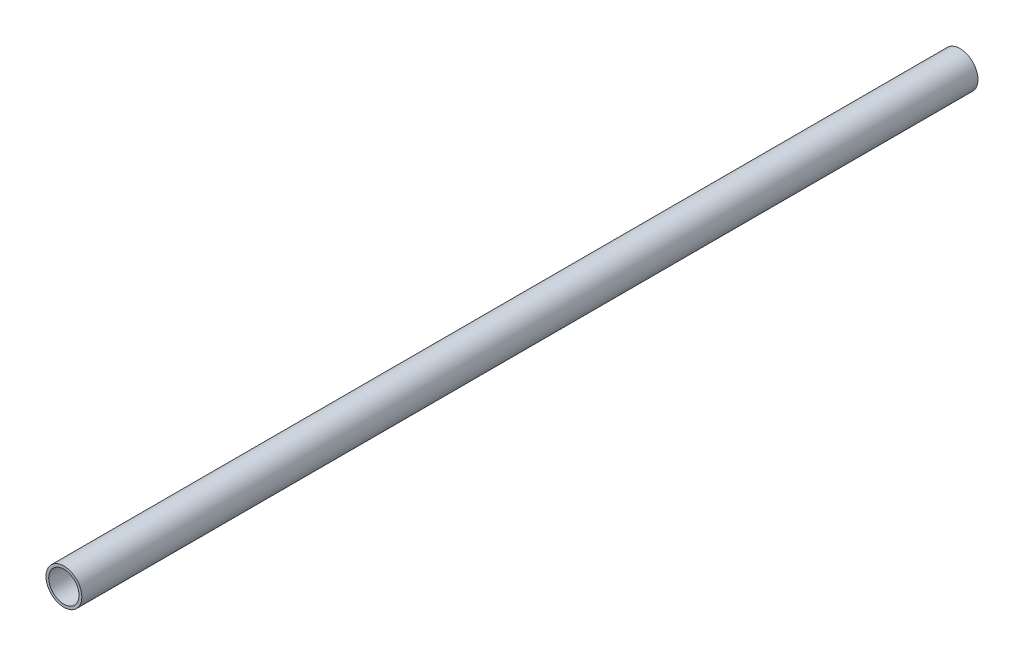
ISO-10303-21;
HEADER;
FILE_DESCRIPTION(('STEP AP214'),'2;1');
FILE_NAME('part.step','',(''),(''),'','','');
FILE_SCHEMA(('AUTOMOTIVE_DESIGN { 1 0 10303 214 1 1 1 1 }'));
ENDSEC;
DATA;
#1=APPLICATION_CONTEXT('core data for automotive mechanical design processes');
#2=APPLICATION_PROTOCOL_DEFINITION('international standard','automotive_design',2000,#1);
#3=PRODUCT_CONTEXT('',#1,'mechanical');
#4=PRODUCT('Part','Part','',(#3));
#5=PRODUCT_RELATED_PRODUCT_CATEGORY('part','',(#4));
#6=PRODUCT_DEFINITION_FORMATION('','',#4);
#7=PRODUCT_DEFINITION_CONTEXT('part definition',#1,'design');
#8=PRODUCT_DEFINITION('design','',#6,#7);
#9=PRODUCT_DEFINITION_SHAPE('','',#8);
#10=(LENGTH_UNIT() NAMED_UNIT(*) SI_UNIT(.MILLI.,.METRE.));
#11=(NAMED_UNIT(*) PLANE_ANGLE_UNIT() SI_UNIT($,.RADIAN.));
#12=(NAMED_UNIT(*) SI_UNIT($,.STERADIAN.) SOLID_ANGLE_UNIT());
#13=UNCERTAINTY_MEASURE_WITH_UNIT(LENGTH_MEASURE(1.E-05),#10,'distance_accuracy_value','');
#14=(GEOMETRIC_REPRESENTATION_CONTEXT(3) GLOBAL_UNCERTAINTY_ASSIGNED_CONTEXT((#13)) GLOBAL_UNIT_ASSIGNED_CONTEXT((#10,
#11,#12)) REPRESENTATION_CONTEXT('',''));
#15=CARTESIAN_POINT('',(0.,0.,0.));
#16=DIRECTION('',(0.,0.,1.));
#17=DIRECTION('',(1.,0.,0.));
#18=AXIS2_PLACEMENT_3D('',#15,#16,#17);
#19=CARTESIAN_POINT('',(0.,0.,1500.));
#20=DIRECTION('',(0.,0.,-1.));
#21=DIRECTION('',(-1.,0.,0.));
#22=AXIS2_PLACEMENT_3D('',#19,#20,#21);
#23=CYLINDRICAL_SURFACE('',#22,30.);
#24=CARTESIAN_POINT('',(0.,0.,1500.));
#25=DIRECTION('',(0.,0.,1.));
#26=DIRECTION('',(1.,0.,0.));
#27=AXIS2_PLACEMENT_3D('',#24,#25,#26);
#28=CIRCLE('',#27,30.);
#29=CARTESIAN_POINT('',(30.,0.,1500.));
#30=VERTEX_POINT('',#29);
#31=EDGE_CURVE('E10',#30,#30,#28,.T.);
#32=ORIENTED_EDGE('',*,*,#31,.F.);
#33=EDGE_LOOP('',(#32));
#34=FACE_BOUND('',#33,.T.);
#35=CARTESIAN_POINT('',(0.,0.,0.));
#36=DIRECTION('',(0.,0.,1.));
#37=DIRECTION('',(1.,0.,0.));
#38=AXIS2_PLACEMENT_3D('',#35,#36,#37);
#39=CIRCLE('',#38,30.);
#40=CARTESIAN_POINT('',(30.,0.,0.));
#41=VERTEX_POINT('',#40);
#42=EDGE_CURVE('E40',#41,#41,#39,.T.);
#43=ORIENTED_EDGE('',*,*,#42,.T.);
#44=EDGE_LOOP('',(#43));
#45=FACE_BOUND('',#44,.T.);
#46=ADVANCED_FACE('F37',(#34,#45),#23,.T.);
#47=CARTESIAN_POINT('',(0.,0.,1500.));
#48=DIRECTION('',(0.,0.,1.));
#49=DIRECTION('',(1.,0.,0.));
#50=AXIS2_PLACEMENT_3D('',#47,#48,#49);
#51=PLANE('',#50);
#52=CARTESIAN_POINT('',(0.,0.,1500.));
#53=DIRECTION('',(0.,0.,1.));
#54=DIRECTION('',(1.,0.,0.));
#55=AXIS2_PLACEMENT_3D('',#52,#53,#54);
#56=CIRCLE('',#55,25.4);
#57=CARTESIAN_POINT('',(25.4,0.,1500.));
#58=VERTEX_POINT('',#57);
#59=EDGE_CURVE('E51',#58,#58,#56,.T.);
#60=ORIENTED_EDGE('',*,*,#59,.F.);
#61=EDGE_LOOP('',(#60));
#62=FACE_BOUND('',#61,.T.);
#63=ORIENTED_EDGE('',*,*,#31,.T.);
#64=EDGE_LOOP('',(#63));
#65=FACE_BOUND('',#64,.T.);
#66=ADVANCED_FACE('F68',(#62,#65),#51,.T.);
#67=CARTESIAN_POINT('',(0.,0.,0.));
#68=DIRECTION('',(0.,0.,1.));
#69=DIRECTION('',(1.,0.,0.));
#70=AXIS2_PLACEMENT_3D('',#67,#68,#69);
#71=PLANE('',#70);
#72=CARTESIAN_POINT('',(0.,0.,0.));
#73=DIRECTION('',(0.,0.,1.));
#74=DIRECTION('',(1.,0.,0.));
#75=AXIS2_PLACEMENT_3D('',#72,#73,#74);
#76=CIRCLE('',#75,25.4);
#77=CARTESIAN_POINT('',(25.4,0.,0.));
#78=VERTEX_POINT('',#77);
#79=EDGE_CURVE('E49',#78,#78,#76,.T.);
#80=ORIENTED_EDGE('',*,*,#79,.T.);
#81=EDGE_LOOP('',(#80));
#82=FACE_BOUND('',#81,.T.);
#83=ORIENTED_EDGE('',*,*,#42,.F.);
#84=EDGE_LOOP('',(#83));
#85=FACE_BOUND('',#84,.T.);
#86=ADVANCED_FACE('F59',(#82,#85),#71,.F.);
#87=CARTESIAN_POINT('',(0.,0.,0.));
#88=DIRECTION('',(0.,0.,1.));
#89=DIRECTION('',(1.,0.,0.));
#90=AXIS2_PLACEMENT_3D('',#87,#88,#89);
#91=CYLINDRICAL_SURFACE('',#90,25.4);
#92=ORIENTED_EDGE('',*,*,#79,.F.);
#93=EDGE_LOOP('',(#92));
#94=FACE_BOUND('',#93,.T.);
#95=ORIENTED_EDGE('',*,*,#59,.T.);
#96=EDGE_LOOP('',(#95));
#97=FACE_BOUND('',#96,.T.);
#98=ADVANCED_FACE('F62',(#94,#97),#91,.F.);
#99=CLOSED_SHELL('',(#46,#66,#86,#98));
#100=MANIFOLD_SOLID_BREP('B2',#99);
#101=ADVANCED_BREP_SHAPE_REPRESENTATION('',(#18,#100),#14);
#102=SHAPE_DEFINITION_REPRESENTATION(#9,#101);
ENDSEC;
END-ISO-10303-21;
